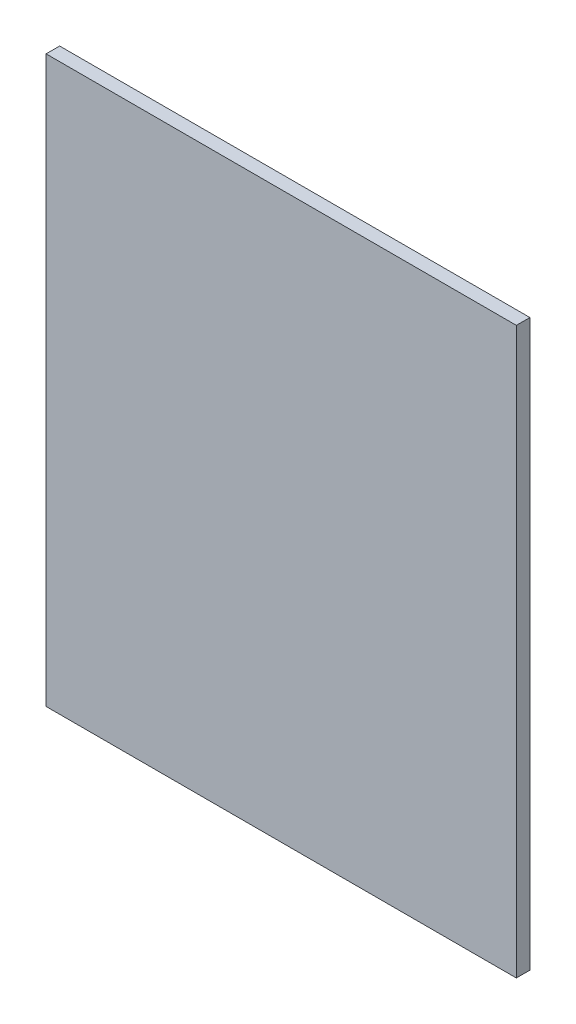
ISO-10303-21;
HEADER;
FILE_DESCRIPTION(('STEP AP214'),'2;1');
FILE_NAME('part.step','',(''),(''),'','','');
FILE_SCHEMA(('AUTOMOTIVE_DESIGN { 1 0 10303 214 1 1 1 1 }'));
ENDSEC;
DATA;
#1=APPLICATION_CONTEXT('core data for automotive mechanical design processes');
#2=APPLICATION_PROTOCOL_DEFINITION('international standard','automotive_design',2000,#1);
#3=PRODUCT_CONTEXT('',#1,'mechanical');
#4=PRODUCT('Part','Part','',(#3));
#5=PRODUCT_RELATED_PRODUCT_CATEGORY('part','',(#4));
#6=PRODUCT_DEFINITION_FORMATION('','',#4);
#7=PRODUCT_DEFINITION_CONTEXT('part definition',#1,'design');
#8=PRODUCT_DEFINITION('design','',#6,#7);
#9=PRODUCT_DEFINITION_SHAPE('','',#8);
#10=(LENGTH_UNIT() NAMED_UNIT(*) SI_UNIT(.MILLI.,.METRE.));
#11=(NAMED_UNIT(*) PLANE_ANGLE_UNIT() SI_UNIT($,.RADIAN.));
#12=(NAMED_UNIT(*) SI_UNIT($,.STERADIAN.) SOLID_ANGLE_UNIT());
#13=UNCERTAINTY_MEASURE_WITH_UNIT(LENGTH_MEASURE(1.E-05),#10,'distance_accuracy_value','');
#14=(GEOMETRIC_REPRESENTATION_CONTEXT(3) GLOBAL_UNCERTAINTY_ASSIGNED_CONTEXT((#13)) GLOBAL_UNIT_ASSIGNED_CONTEXT((#10,
#11,#12)) REPRESENTATION_CONTEXT('',''));
#15=CARTESIAN_POINT('',(0.,0.,0.));
#16=DIRECTION('',(0.,0.,1.));
#17=DIRECTION('',(1.,0.,0.));
#18=AXIS2_PLACEMENT_3D('',#15,#16,#17);
#19=CARTESIAN_POINT('',(-120.156874583611,126.186708860759,6.));
#20=DIRECTION('',(1.,0.,0.));
#21=DIRECTION('',(0.,0.,-1.));
#22=AXIS2_PLACEMENT_3D('',#19,#20,#21);
#23=PLANE('',#22);
#24=DIRECTION('',(0.,-1.,0.));
#25=VECTOR('',#24,1.);
#26=CARTESIAN_POINT('',(-120.156874583611,126.186708860759,0.));
#27=LINE('',#26,#25);
#28=CARTESIAN_POINT('',(-120.156874583611,126.186708860759,0.));
#29=VERTEX_POINT('',#28);
#30=CARTESIAN_POINT('',(-120.156874583611,-123.81329113924,0.));
#31=VERTEX_POINT('',#30);
#32=EDGE_CURVE('E96',#29,#31,#27,.T.);
#33=ORIENTED_EDGE('',*,*,#32,.T.);
#34=DIRECTION('',(0.,0.,-1.));
#35=VECTOR('',#34,1.);
#36=CARTESIAN_POINT('',(-120.156874583611,-123.81329113924,6.));
#37=LINE('',#36,#35);
#38=CARTESIAN_POINT('',(-120.156874583611,-123.81329113924,6.));
#39=VERTEX_POINT('',#38);
#40=EDGE_CURVE('E11',#39,#31,#37,.T.);
#41=ORIENTED_EDGE('',*,*,#40,.F.);
#42=DIRECTION('',(0.,-1.,0.));
#43=VECTOR('',#42,1.);
#44=CARTESIAN_POINT('',(-120.156874583611,126.186708860759,6.));
#45=LINE('',#44,#43);
#46=CARTESIAN_POINT('',(-120.156874583611,126.186708860759,6.));
#47=VERTEX_POINT('',#46);
#48=EDGE_CURVE('E84',#47,#39,#45,.T.);
#49=ORIENTED_EDGE('',*,*,#48,.F.);
#50=DIRECTION('',(0.,0.,-1.));
#51=VECTOR('',#50,1.);
#52=CARTESIAN_POINT('',(-120.156874583611,126.186708860759,6.));
#53=LINE('',#52,#51);
#54=EDGE_CURVE('E92',#47,#29,#53,.T.);
#55=ORIENTED_EDGE('',*,*,#54,.T.);
#56=EDGE_LOOP('',(#33,#41,#49,#55));
#57=FACE_BOUND('',#56,.T.);
#58=ADVANCED_FACE('F33',(#57),#23,.F.);
#59=CARTESIAN_POINT('',(-120.156874583611,-123.81329113924,6.));
#60=DIRECTION('',(0.,1.,0.));
#61=DIRECTION('',(-1.,0.,0.));
#62=AXIS2_PLACEMENT_3D('',#59,#60,#61);
#63=PLANE('',#62);
#64=DIRECTION('',(1.,0.,0.));
#65=VECTOR('',#64,1.);
#66=CARTESIAN_POINT('',(-120.156874583611,-123.81329113924,0.));
#67=LINE('',#66,#65);
#68=CARTESIAN_POINT('',(87.8431254163892,-123.81329113924,0.));
#69=VERTEX_POINT('',#68);
#70=EDGE_CURVE('E88',#31,#69,#67,.T.);
#71=ORIENTED_EDGE('',*,*,#70,.T.);
#72=DIRECTION('',(0.,0.,-1.));
#73=VECTOR('',#72,1.);
#74=CARTESIAN_POINT('',(87.8431254163892,-123.81329113924,6.));
#75=LINE('',#74,#73);
#76=CARTESIAN_POINT('',(87.8431254163892,-123.81329113924,6.));
#77=VERTEX_POINT('',#76);
#78=EDGE_CURVE('E41',#77,#69,#75,.T.);
#79=ORIENTED_EDGE('',*,*,#78,.F.);
#80=DIRECTION('',(1.,0.,0.));
#81=VECTOR('',#80,1.);
#82=CARTESIAN_POINT('',(-120.156874583611,-123.81329113924,6.));
#83=LINE('',#82,#81);
#84=EDGE_CURVE('E79',#39,#77,#83,.T.);
#85=ORIENTED_EDGE('',*,*,#84,.F.);
#86=ORIENTED_EDGE('',*,*,#40,.T.);
#87=EDGE_LOOP('',(#71,#79,#85,#86));
#88=FACE_BOUND('',#87,.T.);
#89=ADVANCED_FACE('F87',(#88),#63,.F.);
#90=CARTESIAN_POINT('',(87.8431254163891,126.186708860759,6.));
#91=DIRECTION('',(-1.,0.,0.));
#92=DIRECTION('',(0.,-1.,0.));
#93=AXIS2_PLACEMENT_3D('',#90,#91,#92);
#94=PLANE('',#93);
#95=DIRECTION('',(0.,1.,0.));
#96=VECTOR('',#95,1.);
#97=CARTESIAN_POINT('',(87.8431254163891,126.186708860759,0.));
#98=LINE('',#97,#96);
#99=CARTESIAN_POINT('',(87.8431254163891,126.186708860759,0.));
#100=VERTEX_POINT('',#99);
#101=EDGE_CURVE('E66',#69,#100,#98,.T.);
#102=ORIENTED_EDGE('',*,*,#101,.T.);
#103=DIRECTION('',(0.,0.,-1.));
#104=VECTOR('',#103,1.);
#105=CARTESIAN_POINT('',(87.8431254163891,126.186708860759,6.));
#106=LINE('',#105,#104);
#107=CARTESIAN_POINT('',(87.8431254163891,126.186708860759,6.));
#108=VERTEX_POINT('',#107);
#109=EDGE_CURVE('E89',#108,#100,#106,.T.);
#110=ORIENTED_EDGE('',*,*,#109,.F.);
#111=DIRECTION('',(0.,1.,0.));
#112=VECTOR('',#111,1.);
#113=CARTESIAN_POINT('',(87.8431254163891,126.186708860759,6.));
#114=LINE('',#113,#112);
#115=EDGE_CURVE('E82',#77,#108,#114,.T.);
#116=ORIENTED_EDGE('',*,*,#115,.F.);
#117=ORIENTED_EDGE('',*,*,#78,.T.);
#118=EDGE_LOOP('',(#102,#110,#116,#117));
#119=FACE_BOUND('',#118,.T.);
#120=ADVANCED_FACE('F90',(#119),#94,.F.);
#121=CARTESIAN_POINT('',(-120.156874583611,126.186708860759,6.));
#122=DIRECTION('',(0.,-1.,0.));
#123=DIRECTION('',(0.,0.,-1.));
#124=AXIS2_PLACEMENT_3D('',#121,#122,#123);
#125=PLANE('',#124);
#126=DIRECTION('',(-1.,0.,0.));
#127=VECTOR('',#126,1.);
#128=CARTESIAN_POINT('',(-120.156874583611,126.186708860759,0.));
#129=LINE('',#128,#127);
#130=EDGE_CURVE('E72',#100,#29,#129,.T.);
#131=ORIENTED_EDGE('',*,*,#130,.T.);
#132=ORIENTED_EDGE('',*,*,#54,.F.);
#133=DIRECTION('',(-1.,0.,0.));
#134=VECTOR('',#133,1.);
#135=CARTESIAN_POINT('',(-120.156874583611,126.186708860759,6.));
#136=LINE('',#135,#134);
#137=EDGE_CURVE('E49',#108,#47,#136,.T.);
#138=ORIENTED_EDGE('',*,*,#137,.F.);
#139=ORIENTED_EDGE('',*,*,#109,.T.);
#140=EDGE_LOOP('',(#131,#132,#138,#139));
#141=FACE_BOUND('',#140,.T.);
#142=ADVANCED_FACE('F103',(#141),#125,.F.);
#143=CARTESIAN_POINT('',(0.,0.,6.));
#144=DIRECTION('',(0.,0.,1.));
#145=DIRECTION('',(1.,0.,0.));
#146=AXIS2_PLACEMENT_3D('',#143,#144,#145);
#147=PLANE('',#146);
#148=ORIENTED_EDGE('',*,*,#48,.T.);
#149=ORIENTED_EDGE('',*,*,#84,.T.);
#150=ORIENTED_EDGE('',*,*,#115,.T.);
#151=ORIENTED_EDGE('',*,*,#137,.T.);
#152=EDGE_LOOP('',(#148,#149,#150,#151));
#153=FACE_BOUND('',#152,.T.);
#154=ADVANCED_FACE('F80',(#153),#147,.T.);
#155=CARTESIAN_POINT('',(0.,0.,0.));
#156=DIRECTION('',(0.,0.,1.));
#157=DIRECTION('',(1.,0.,0.));
#158=AXIS2_PLACEMENT_3D('',#155,#156,#157);
#159=PLANE('',#158);
#160=ORIENTED_EDGE('',*,*,#32,.F.);
#161=ORIENTED_EDGE('',*,*,#130,.F.);
#162=ORIENTED_EDGE('',*,*,#101,.F.);
#163=ORIENTED_EDGE('',*,*,#70,.F.);
#164=EDGE_LOOP('',(#160,#161,#162,#163));
#165=FACE_BOUND('',#164,.T.);
#166=ADVANCED_FACE('F106',(#165),#159,.F.);
#167=CLOSED_SHELL('',(#58,#89,#120,#142,#154,#166));
#168=MANIFOLD_SOLID_BREP('B2',#167);
#169=ADVANCED_BREP_SHAPE_REPRESENTATION('',(#18,#168),#14);
#170=SHAPE_DEFINITION_REPRESENTATION(#9,#169);
ENDSEC;
END-ISO-10303-21;
